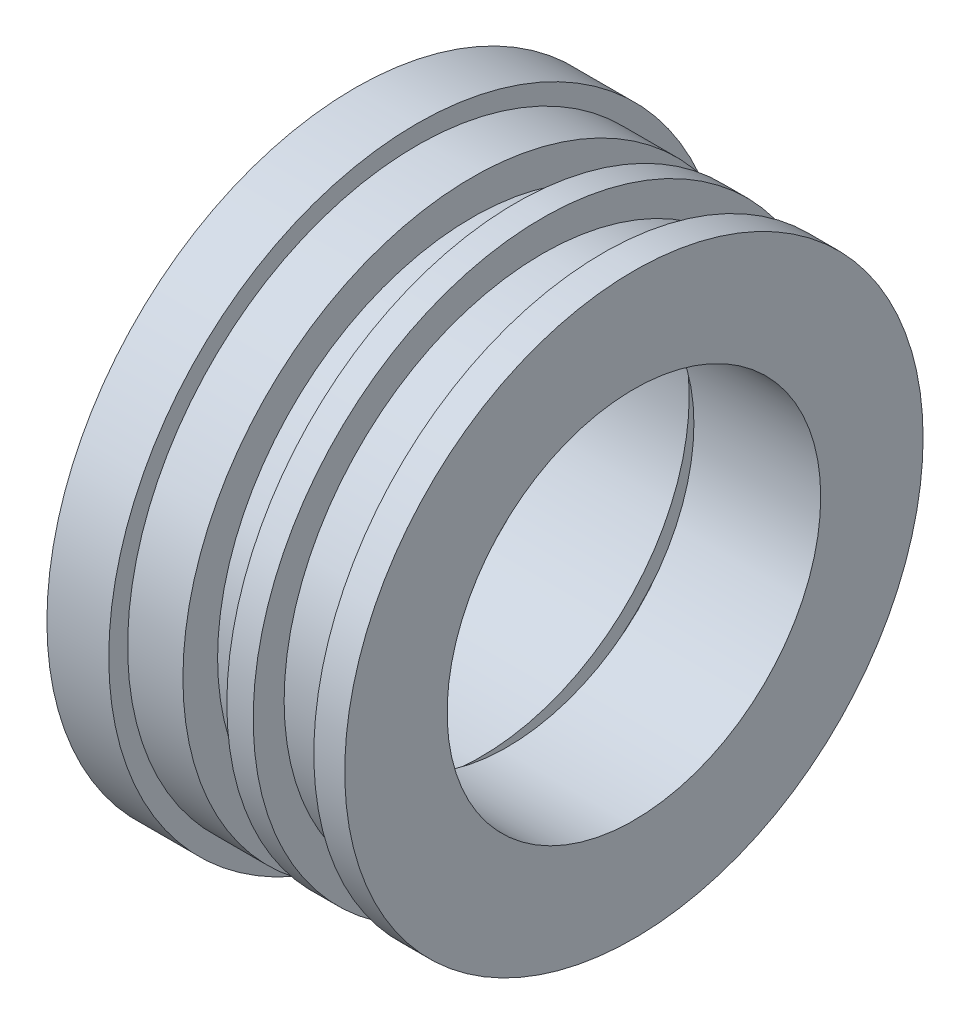
ISO-10303-21;
HEADER;
FILE_DESCRIPTION(('STEP AP214'),'2;1');
FILE_NAME('part.step','',(''),(''),'','','');
FILE_SCHEMA(('AUTOMOTIVE_DESIGN { 1 0 10303 214 1 1 1 1 }'));
ENDSEC;
DATA;
#1=APPLICATION_CONTEXT('core data for automotive mechanical design processes');
#2=APPLICATION_PROTOCOL_DEFINITION('international standard','automotive_design',2000,#1);
#3=PRODUCT_CONTEXT('',#1,'mechanical');
#4=PRODUCT('Part','Part','',(#3));
#5=PRODUCT_RELATED_PRODUCT_CATEGORY('part','',(#4));
#6=PRODUCT_DEFINITION_FORMATION('','',#4);
#7=PRODUCT_DEFINITION_CONTEXT('part definition',#1,'design');
#8=PRODUCT_DEFINITION('design','',#6,#7);
#9=PRODUCT_DEFINITION_SHAPE('','',#8);
#10=(LENGTH_UNIT() NAMED_UNIT(*) SI_UNIT(.MILLI.,.METRE.));
#11=(NAMED_UNIT(*) PLANE_ANGLE_UNIT() SI_UNIT($,.RADIAN.));
#12=(NAMED_UNIT(*) SI_UNIT($,.STERADIAN.) SOLID_ANGLE_UNIT());
#13=UNCERTAINTY_MEASURE_WITH_UNIT(LENGTH_MEASURE(1.E-05),#10,'distance_accuracy_value','');
#14=(GEOMETRIC_REPRESENTATION_CONTEXT(3) GLOBAL_UNCERTAINTY_ASSIGNED_CONTEXT((#13)) GLOBAL_UNIT_ASSIGNED_CONTEXT((#10,
#11,#12)) REPRESENTATION_CONTEXT('',''));
#15=CARTESIAN_POINT('',(0.,0.,0.));
#16=DIRECTION('',(0.,0.,1.));
#17=DIRECTION('',(1.,0.,0.));
#18=AXIS2_PLACEMENT_3D('',#15,#16,#17);
#19=CARTESIAN_POINT('',(0.,0.,0.));
#20=DIRECTION('',(1.,0.,0.));
#21=DIRECTION('',(0.,0.,-1.));
#22=AXIS2_PLACEMENT_3D('',#19,#20,#21);
#23=CYLINDRICAL_SURFACE('',#22,11.8745);
#24=CARTESIAN_POINT('',(-3.7084,0.,0.));
#25=DIRECTION('',(1.,0.,0.));
#26=DIRECTION('',(0.,0.,-1.));
#27=AXIS2_PLACEMENT_3D('',#24,#25,#26);
#28=CIRCLE('',#27,11.8745);
#29=CARTESIAN_POINT('',(-3.7084,0.,-11.8745));
#30=VERTEX_POINT('',#29);
#31=EDGE_CURVE('E96',#30,#30,#28,.T.);
#32=ORIENTED_EDGE('',*,*,#31,.T.);
#33=EDGE_LOOP('',(#32));
#34=FACE_BOUND('',#33,.T.);
#35=CARTESIAN_POINT('',(-1.43830595774119,0.,0.));
#36=DIRECTION('',(-1.,0.,0.));
#37=DIRECTION('',(0.,0.,1.));
#38=AXIS2_PLACEMENT_3D('',#35,#36,#37);
#39=CIRCLE('',#38,11.8745);
#40=CARTESIAN_POINT('',(-1.43830595774119,0.,11.8745));
#41=VERTEX_POINT('',#40);
#42=EDGE_CURVE('E109',#41,#41,#39,.T.);
#43=ORIENTED_EDGE('',*,*,#42,.T.);
#44=EDGE_LOOP('',(#43));
#45=FACE_BOUND('',#44,.T.);
#46=ADVANCED_FACE('F47',(#34,#45),#23,.T.);
#47=CARTESIAN_POINT('',(1.4478,0.,0.));
#48=DIRECTION('',(1.,0.,0.));
#49=DIRECTION('',(0.,0.,-1.));
#50=AXIS2_PLACEMENT_3D('',#47,#48,#49);
#51=CIRCLE('',#50,11.8745);
#52=CARTESIAN_POINT('',(1.4478,0.,-11.8745));
#53=VERTEX_POINT('',#52);
#54=EDGE_CURVE('E93',#53,#53,#51,.T.);
#55=ORIENTED_EDGE('',*,*,#54,.F.);
#56=EDGE_LOOP('',(#55));
#57=FACE_BOUND('',#56,.T.);
#58=CARTESIAN_POINT('',(0.364997855458809,0.,0.));
#59=DIRECTION('',(-1.,0.,0.));
#60=DIRECTION('',(0.,0.,1.));
#61=AXIS2_PLACEMENT_3D('',#58,#59,#60);
#62=CIRCLE('',#61,11.8745);
#63=CARTESIAN_POINT('',(0.364997855458809,0.,11.8745));
#64=VERTEX_POINT('',#63);
#65=EDGE_CURVE('E329',#64,#64,#62,.T.);
#66=ORIENTED_EDGE('',*,*,#65,.F.);
#67=EDGE_LOOP('',(#66));
#68=FACE_BOUND('',#67,.T.);
#69=ADVANCED_FACE('F117',(#57,#68),#23,.T.);
#70=CARTESIAN_POINT('',(-0.536654051141194,11.8745,0.));
#71=DIRECTION('',(0.,1.,0.));
#72=DIRECTION('',(0.,0.,1.));
#73=AXIS2_PLACEMENT_3D('',#70,#71,#72);
#74=CYLINDRICAL_SURFACE('',#73,0.396874999999999);
#75=CARTESIAN_POINT('',(-0.536654051141194,9.16290753093205,0.396874999999999));
#76=CARTESIAN_POINT('',(-0.55893549420947,9.16290764654025,0.396874015394312));
#77=CARTESIAN_POINT('',(-0.581232827780028,9.1629896769545,0.394992304834452));
#78=CARTESIAN_POINT('',(-0.625212646336671,9.16330900125434,0.387512330730099));
#79=CARTESIAN_POINT('',(-0.64689437119094,9.1635464790644,0.381909664457492));
#80=CARTESIAN_POINT('',(-0.688999499810687,9.16414974734482,0.36714826181482));
#81=CARTESIAN_POINT('',(-0.709423528939222,9.16451547343076,0.357991309554863));
#82=CARTESIAN_POINT('',(-0.74843896426603,9.16533394661552,0.336383936914734));
#83=CARTESIAN_POINT('',(-0.76703080738109,9.16578667289128,0.323934304353078));
#84=CARTESIAN_POINT('',(-0.8018744901568,9.16672854626737,0.296083826634229));
#85=CARTESIAN_POINT('',(-0.818124707018885,9.16721771827261,0.280680951880479));
#86=CARTESIAN_POINT('',(-0.847810060504705,9.16817712466524,0.247365161774987));
#87=CARTESIAN_POINT('',(-0.861245083326749,9.16864735828644,0.229452145001837));
#88=CARTESIAN_POINT('',(-0.884922697491104,9.16951606742829,0.191616632712358));
#89=CARTESIAN_POINT('',(-0.895164092616592,9.16991451603736,0.171693387927077));
#90=CARTESIAN_POINT('',(-0.912156038355141,9.17059451015949,0.130408257615304));
#91=CARTESIAN_POINT('',(-0.918906610510032,9.17087605639396,0.109046380967512));
#92=CARTESIAN_POINT('',(-0.928721185755424,9.17129035519573,0.0655046837947326));
#93=CARTESIAN_POINT('',(-0.931787517067236,9.17142320172877,0.0433253889738296));
#94=CARTESIAN_POINT('',(-0.934153750700042,9.17152544391363,-0.00123349577028818));
#95=CARTESIAN_POINT('',(-0.933453676933559,9.17149484060316,-0.0236130844209572));
#96=CARTESIAN_POINT('',(-0.928308913164991,9.17127371163039,-0.0679215175590638));
#97=CARTESIAN_POINT('',(-0.923866730706775,9.17108329305877,-0.0898506538120457));
#98=CARTESIAN_POINT('',(-0.911367731529938,9.17056411004272,-0.132651670910134));
#99=CARTESIAN_POINT('',(-0.903310902466991,9.17023534512582,-0.15352354814434));
#100=CARTESIAN_POINT('',(-0.883808447024237,9.16947632596091,-0.1936256502077));
#101=CARTESIAN_POINT('',(-0.872361675478607,9.16904603742692,-0.212855317444607));
#102=CARTESIAN_POINT('',(-0.84640510666651,9.16813244208049,-0.249121040272883));
#103=CARTESIAN_POINT('',(-0.831895293504161,9.16764913499291,-0.266157084479543));
#104=CARTESIAN_POINT('',(-0.800210339645169,9.16668347797584,-0.297566591025905));
#105=CARTESIAN_POINT('',(-0.783033023621281,9.16620112915587,-0.311937859087363));
#106=CARTESIAN_POINT('',(-0.746508317749233,9.16529216655227,-0.337592967010331));
#107=CARTESIAN_POINT('',(-0.727160927424006,9.1648655527809,-0.348876806193099));
#108=CARTESIAN_POINT('',(-0.686843983818843,9.1641161973683,-0.368036540637774));
#109=CARTESIAN_POINT('',(-0.665874393390031,9.16379345810671,-0.375912357827693));
#110=CARTESIAN_POINT('',(-0.622908881237655,9.16328833993912,-0.388031038375738));
#111=CARTESIAN_POINT('',(-0.600912965299867,9.16310596024195,-0.392273922211447));
#112=CARTESIAN_POINT('',(-0.556538290268574,9.16290227263207,-0.39700359082162));
#113=CARTESIAN_POINT('',(-0.534159856131958,9.16288083420858,-0.397493419036865));
#114=CARTESIAN_POINT('',(-0.489638597404038,9.16300110603511,-0.39471100987086));
#115=CARTESIAN_POINT('',(-0.467495772232488,9.16314281588323,-0.391438781756776));
#116=CARTESIAN_POINT('',(-0.424082810766057,9.16357329202787,-0.38122766917061));
#117=CARTESIAN_POINT('',(-0.402812347132656,9.16386200260918,-0.374290173845575));
#118=CARTESIAN_POINT('',(-0.361737826979347,9.16455389021936,-0.356946863162246));
#119=CARTESIAN_POINT('',(-0.341933776782567,9.16495706774178,-0.346541032849665));
#120=CARTESIAN_POINT('',(-0.304340238377882,9.165832762278,-0.322548610727813));
#121=CARTESIAN_POINT('',(-0.286552057350855,9.16630532383285,-0.308959972356012));
#122=CARTESIAN_POINT('',(-0.253508339851837,9.16726636302114,-0.278990661224119));
#123=CARTESIAN_POINT('',(-0.238252815749091,9.16775484073229,-0.262609974828733));
#124=CARTESIAN_POINT('',(-0.21069725913481,9.16869303302902,-0.22750849690576));
#125=CARTESIAN_POINT('',(-0.198399191037115,9.16914272172353,-0.208786162478011));
#126=CARTESIAN_POINT('',(-0.177121069980114,9.1699522819356,-0.169540668559037));
#127=CARTESIAN_POINT('',(-0.168141005297789,9.17031215377049,-0.1490175154307));
#128=CARTESIAN_POINT('',(-0.153757243470496,9.170901395225,-0.106760307309313));
#129=CARTESIAN_POINT('',(-0.148352283501601,9.17113081092126,-0.0850266828317771));
#130=CARTESIAN_POINT('',(-0.141268020872158,9.17143346581654,-0.0409594192158822));
#131=CARTESIAN_POINT('',(-0.139588704159097,9.17150670560463,-0.0186257823409932));
#132=CARTESIAN_POINT('',(-0.140003541822074,9.17148875702802,0.0259880023150937));
#133=CARTESIAN_POINT('',(-0.142094610861622,9.17139770310611,0.0482681789053225));
#134=CARTESIAN_POINT('',(-0.149984494418193,9.17106168562975,0.0921608663180783));
#135=CARTESIAN_POINT('',(-0.155783316080874,9.17081672177868,0.113773375853779));
#136=CARTESIAN_POINT('',(-0.170923512723298,9.17020045675352,0.155717998666665));
#137=CARTESIAN_POINT('',(-0.180264929918024,9.16982915407393,0.176050096682589));
#138=CARTESIAN_POINT('',(-0.202224513044887,9.16900200011743,0.214857363513308));
#139=CARTESIAN_POINT('',(-0.21484257138589,9.16854615161679,0.233332593272234));
#140=CARTESIAN_POINT('',(-0.243007938377383,9.16760081906724,0.267916860190384));
#141=CARTESIAN_POINT('',(-0.25855732117506,9.16711131135848,0.284024207431201));
#142=CARTESIAN_POINT('',(-0.292144023722983,9.16615395986057,0.313404649946203));
#143=CARTESIAN_POINT('',(-0.31018195616656,9.16568612144451,0.326677045184091));
#144=CARTESIAN_POINT('',(-0.348245100441699,9.16482461786264,0.35001548555261));
#145=CARTESIAN_POINT('',(-0.368271962194627,9.16443101507716,0.360078838980908));
#146=CARTESIAN_POINT('',(-0.409717533260866,9.16376340667975,0.376688413917017));
#147=CARTESIAN_POINT('',(-0.431134558401075,9.16348925934459,0.383238805382872));
#148=CARTESIAN_POINT('',(-0.466680285249897,9.16316433715958,0.390911360653705));
#149=CARTESIAN_POINT('',(-0.480578553979618,9.16306845705027,0.393144886446108));
#150=CARTESIAN_POINT('',(-0.508533788815366,9.16294001747247,0.39612701637594));
#151=CARTESIAN_POINT('',(-0.522590754821293,9.16290745796404,0.396875621449942));
#152=CARTESIAN_POINT('',(-0.536654051141194,9.16290753093205,0.396874999999999));
#153=B_SPLINE_CURVE_WITH_KNOTS('',3,(#75,#76,#77,#78,#79,#80,#81,#82,#83,#84,#85,#86,#87,#88,
#89,#90,#91,#92,#93,#94,#95,#96,#97,#98,#99,#100,#101,#102,#103,#104,#105,#106,#107,#108,#109,
#110,#111,#112,#113,#114,#115,#116,#117,#118,#119,#120,#121,#122,#123,#124,#125,#126,#127,#128,
#129,#130,#131,#132,#133,#134,#135,#136,#137,#138,#139,#140,#141,#142,#143,#144,#145,#146,#147,
#148,#149,#150,#151,#152),.UNSPECIFIED.,.T.,.F.,(4,2,2,2,2,2,2,2,2,2,2,2,2,2,2,2,2,2,2,2,2,2,2,
2,2,2,2,2,2,2,2,2,2,2,2,2,2,2,4),(0.,0.066792994182018,0.133665160646893,0.20050380326467,
0.267326468273378,0.334195222407943,0.401066679130561,0.467963153466716,0.534859214980546,
0.601712979886322,0.66856632034487,0.735374898752619,0.802183705319103,0.869015106547053,
0.93584685461005,1.00273339243748,1.06961994496926,1.13650802967711,1.20339573735761,
1.27022919848142,1.33706249497307,1.40387047960057,1.47067875228522,1.53753010155023,
1.60438177730097,1.67127773565758,1.73817345765813,1.80504553763919,1.87191736538931,
1.93873449622626,2.00555175583498,2.07236981168991,2.13918567379787,2.20604899215641,
2.27292880207334,2.33986456323509,2.40672069341798,2.44887820803022,2.49103569605273),.UNSPECIFIED.);
#154=CARTESIAN_POINT('',(-0.536654051141194,9.16290753093205,0.396874999999999));
#155=VERTEX_POINT('',#154);
#156=EDGE_CURVE('E102',#155,#155,#153,.T.);
#157=ORIENTED_EDGE('',*,*,#156,.T.);
#158=EDGE_LOOP('',(#157));
#159=FACE_BOUND('',#158,.T.);
#160=CARTESIAN_POINT('',(-0.536654051141194,10.4428558993721,0.396874999999999));
#161=CARTESIAN_POINT('',(-0.55893806821995,10.4428560009423,0.396874014454095));
#162=CARTESIAN_POINT('',(-0.581238038719293,10.4429279935437,0.394991870861255));
#163=CARTESIAN_POINT('',(-0.625223235145033,10.4432082482024,0.387510076336908));
#164=CARTESIAN_POINT('',(-0.646907698136307,10.4434166722796,0.381906005292855));
#165=CARTESIAN_POINT('',(-0.689018317105908,10.4439461461416,0.367140651888283));
#166=CARTESIAN_POINT('',(-0.709445091611033,10.4442671400363,0.357981134537887));
#167=CARTESIAN_POINT('',(-0.748465473860025,10.4449855128291,0.336367486687425));
#168=CARTESIAN_POINT('',(-0.767059522599934,10.4453828732834,0.323914151425433));
#169=CARTESIAN_POINT('',(-0.801904281667392,10.4462095005498,0.296057208971475));
#170=CARTESIAN_POINT('',(-0.818153685122021,10.4466387849556,0.280651967478336));
#171=CARTESIAN_POINT('',(-0.847836820727282,10.4474807172426,0.247331584352272));
#172=CARTESIAN_POINT('',(-0.861270439805925,10.4478933644551,0.229416341974728));
#173=CARTESIAN_POINT('',(-0.884943540794917,10.4486556248149,0.191578600347924));
#174=CARTESIAN_POINT('',(-0.895182115343414,10.4490052200439,0.17165553301699));
#175=CARTESIAN_POINT('',(-0.912168634879512,10.4496018136629,0.130371706655994));
#176=CARTESIAN_POINT('',(-0.918916598066946,10.4498488125876,0.109010955122586));
#177=CARTESIAN_POINT('',(-0.928727196379884,10.4502122663807,0.0654691252835978));
#178=CARTESIAN_POINT('',(-0.931791623576207,10.450328784727,0.0432884512955195));
#179=CARTESIAN_POINT('',(-0.934153687813634,10.4504183570732,-0.00127277281257569));
#180=CARTESIAN_POINT('',(-0.933451344838731,10.4503914118341,-0.0236533218715586));
#181=CARTESIAN_POINT('',(-0.928301305358876,10.4501971479455,-0.0679668587195005));
#182=CARTESIAN_POINT('',(-0.923855540328519,10.4500299016865,-0.0899000713421345));
#183=CARTESIAN_POINT('',(-0.911347846418612,10.4495739645296,-0.132708639202626));
#184=CARTESIAN_POINT('',(-0.90328590713117,10.4492852732823,-0.15358399139561));
#185=CARTESIAN_POINT('',(-0.883772501793676,10.4486188522676,-0.193690485499082));
#186=CARTESIAN_POINT('',(-0.872320152290199,10.4482410992983,-0.212921197173207));
#187=CARTESIAN_POINT('',(-0.846351667551777,10.4474391162008,-0.249187810050953));
#188=CARTESIAN_POINT('',(-0.83183552035259,10.4470148858911,-0.266223702683308));
#189=CARTESIAN_POINT('',(-0.800140572758892,10.4461674295161,-0.297628351243839));
#190=CARTESIAN_POINT('',(-0.782960096753091,10.445744204254,-0.311995416147774));
#191=CARTESIAN_POINT('',(-0.746430083571325,10.4449467417778,-0.337641559854101));
#192=CARTESIAN_POINT('',(-0.727080545976638,10.444572504573,-0.348920638060376));
#193=CARTESIAN_POINT('',(-0.686760696798609,10.4439152377216,-0.368070465598597));
#194=CARTESIAN_POINT('',(-0.665790357732298,10.4436322096219,-0.375941157121605));
#195=CARTESIAN_POINT('',(-0.622824617876909,10.4431893386804,-0.38804968889572));
#196=CARTESIAN_POINT('',(-0.600829221544799,10.443029495303,-0.392287544940908));
#197=CARTESIAN_POINT('',(-0.556452454791846,10.4428511157939,-0.397008028056378));
#198=CARTESIAN_POINT('',(-0.534071334076011,10.4428324914488,-0.397492999394221));
#199=CARTESIAN_POINT('',(-0.489545506504722,10.4429384199271,-0.394700058521904));
#200=CARTESIAN_POINT('',(-0.467400799203537,10.4430629724805,-0.391422153407488));
#201=CARTESIAN_POINT('',(-0.423982961766447,10.4434411343892,-0.381198449850113));
#202=CARTESIAN_POINT('',(-0.402709579801709,10.4436947061671,-0.374253719362707));
#203=CARTESIAN_POINT('',(-0.361630525191999,10.4443022912521,-0.356894582386977));
#204=CARTESIAN_POINT('',(-0.341824857385168,10.4446563048903,-0.346480164461871));
#205=CARTESIAN_POINT('',(-0.304232647440754,10.4454250834767,-0.322471246027634));
#206=CARTESIAN_POINT('',(-0.286447113443857,10.4458398785232,-0.308875167989394));
#207=CARTESIAN_POINT('',(-0.253410168674286,10.4466833563122,-0.278891184370213));
#208=CARTESIAN_POINT('',(-0.238158767660977,10.4471120391083,-0.262503268037937));
#209=CARTESIAN_POINT('',(-0.210615177459123,10.4479352270029,-0.227390750259213));
#210=CARTESIAN_POINT('',(-0.198324500710201,10.4483297145677,-0.208664961931504));
#211=CARTESIAN_POINT('',(-0.177061583929939,10.4490397965235,-0.169414288742466));
#212=CARTESIAN_POINT('',(-0.168089334048794,10.4493553911486,-0.14888940922145));
#213=CARTESIAN_POINT('',(-0.153720612163672,10.4498720304327,-0.106628856195161));
#214=CARTESIAN_POINT('',(-0.148323164587921,10.4500731063421,-0.0848935147845179));
#215=CARTESIAN_POINT('',(-0.141254063748455,10.4503381676735,-0.0408243428326085));
#216=CARTESIAN_POINT('',(-0.139582401207219,10.4504021534369,-0.0184905137817671));
#217=CARTESIAN_POINT('',(-0.140012432308906,10.4503858243691,0.0261265912113033));
#218=CARTESIAN_POINT('',(-0.142111747864787,10.4503056004808,0.0484098901468196));
#219=CARTESIAN_POINT('',(-0.150019241516118,10.4500100675168,0.092307488946538));
#220=CARTESIAN_POINT('',(-0.155827426853614,10.4497947581775,0.113921787504344));
#221=CARTESIAN_POINT('',(-0.170987373310459,10.4492532964665,0.155868524391291));
#222=CARTESIAN_POINT('',(-0.180339185379096,10.4489271425011,0.176200944285031));
#223=CARTESIAN_POINT('',(-0.20232033967993,10.44820071751,0.215006935595023));
#224=CARTESIAN_POINT('',(-0.214949569474729,10.4478004490271,0.233480570749885));
#225=CARTESIAN_POINT('',(-0.243134955791281,10.4469706047665,0.268056080897783));
#226=CARTESIAN_POINT('',(-0.258692640835452,10.4465410137588,0.284156709427179));
#227=CARTESIAN_POINT('',(-0.292294726232388,10.445700998314,0.313522227842461));
#228=CARTESIAN_POINT('',(-0.310339740030676,10.4452905786387,0.326786416116729));
#229=CARTESIAN_POINT('',(-0.348413711650637,10.4445350046134,0.350106119504125));
#230=CARTESIAN_POINT('',(-0.368444153026003,10.4441898996368,0.360159211170823));
#231=CARTESIAN_POINT('',(-0.409894574539445,10.4436047248024,0.376747928479295));
#232=CARTESIAN_POINT('',(-0.431312868857983,10.4433645301586,0.383287735157076));
#233=CARTESIAN_POINT('',(-0.466830438823598,10.4430802624131,0.390937117466862));
#234=CARTESIAN_POINT('',(-0.48069933462026,10.4429964936714,0.393161007753105));
#235=CARTESIAN_POINT('',(-0.508594728573561,10.4428842801835,0.396130258976751));
#236=CARTESIAN_POINT('',(-0.522621226654547,10.4428558354107,0.396875620623859));
#237=CARTESIAN_POINT('',(-0.536654051141194,10.4428558993721,0.396874999999999));
#238=B_SPLINE_CURVE_WITH_KNOTS('',3,(#160,#161,#162,#163,#164,#165,#166,#167,#168,#169,#170,
#171,#172,#173,#174,#175,#176,#177,#178,#179,#180,#181,#182,#183,#184,#185,#186,#187,#188,#189,
#190,#191,#192,#193,#194,#195,#196,#197,#198,#199,#200,#201,#202,#203,#204,#205,#206,#207,#208,
#209,#210,#211,#212,#213,#214,#215,#216,#217,#218,#219,#220,#221,#222,#223,#224,#225,#226,#227,
#228,#229,#230,#231,#232,#233,#234,#235,#236,#237),.UNSPECIFIED.,.T.,.F.,(4,2,2,2,2,2,2,2,2,2,2,
2,2,2,2,2,2,2,2,2,2,2,2,2,2,2,2,2,2,2,2,2,2,2,2,2,2,2,4),(0.,0.0668008284005457,
0.133681130790567,0.200528274542901,0.267359293862375,0.334227421152642,0.401098233117286,
0.467988018501752,0.534877455123475,0.601734336291143,0.668590862760743,0.735412914728533,
0.802235159021433,0.869074830816042,0.935914763626861,1.00279690420532,1.06967905769497,
1.1365623455145,1.20344534255138,1.27028655724772,1.33712764590021,1.40394927794891,
1.47077113025722,1.53762618460459,1.6044814964158,1.67137088813556,1.73826008131164,
1.8051310127432,1.87200177766026,1.93883038675719,2.00565912634597,2.07248882681641,
2.13931623488318,2.2061786210739,2.27305752702094,2.33998678853001,2.40683622245256,
2.44890245975421,2.49096867686374),.UNSPECIFIED.);
#239=CARTESIAN_POINT('',(-0.536654051141194,10.4428558993721,0.396874999999999));
#240=VERTEX_POINT('',#239);
#241=EDGE_CURVE('E51',#240,#240,#238,.T.);
#242=ORIENTED_EDGE('',*,*,#241,.F.);
#243=EDGE_LOOP('',(#242));
#244=FACE_BOUND('',#243,.T.);
#245=ADVANCED_FACE('F113',(#159,#244),#74,.F.);
#246=CARTESIAN_POINT('',(0.,0.,0.));
#247=DIRECTION('',(1.,0.,0.));
#248=DIRECTION('',(0.,0.,-1.));
#249=AXIS2_PLACEMENT_3D('',#246,#247,#248);
#250=CYLINDRICAL_SURFACE('',#249,12.6492);
#251=CARTESIAN_POINT('',(-6.2484,0.,0.));
#252=DIRECTION('',(1.,0.,0.));
#253=DIRECTION('',(0.,0.,-1.));
#254=AXIS2_PLACEMENT_3D('',#251,#252,#253);
#255=CIRCLE('',#254,12.6492);
#256=CARTESIAN_POINT('',(-6.2484,0.,-12.6492));
#257=VERTEX_POINT('',#256);
#258=EDGE_CURVE('E12',#257,#257,#255,.T.);
#259=ORIENTED_EDGE('',*,*,#258,.T.);
#260=EDGE_LOOP('',(#259));
#261=FACE_BOUND('',#260,.T.);
#262=CARTESIAN_POINT('',(-3.7084,0.,0.));
#263=DIRECTION('',(1.,0.,0.));
#264=DIRECTION('',(0.,0.,-1.));
#265=AXIS2_PLACEMENT_3D('',#262,#263,#264);
#266=CIRCLE('',#265,12.6492);
#267=CARTESIAN_POINT('',(-3.7084,0.,-12.6492));
#268=VERTEX_POINT('',#267);
#269=EDGE_CURVE('E99',#268,#268,#266,.T.);
#270=ORIENTED_EDGE('',*,*,#269,.F.);
#271=EDGE_LOOP('',(#270));
#272=FACE_BOUND('',#271,.T.);
#273=ADVANCED_FACE('F49',(#261,#272),#250,.T.);
#274=CARTESIAN_POINT('',(-6.2484,12.6492,0.));
#275=DIRECTION('',(-1.,0.,0.));
#276=DIRECTION('',(0.,0.,1.));
#277=AXIS2_PLACEMENT_3D('',#274,#275,#276);
#278=PLANE('',#277);
#279=CARTESIAN_POINT('',(-6.2484,0.,0.));
#280=DIRECTION('',(1.,0.,0.));
#281=DIRECTION('',(0.,0.,-1.));
#282=AXIS2_PLACEMENT_3D('',#279,#280,#281);
#283=CIRCLE('',#282,8.550800018);
#284=CARTESIAN_POINT('',(-6.2484,0.,-8.550800018));
#285=VERTEX_POINT('',#284);
#286=EDGE_CURVE('E60',#285,#285,#283,.T.);
#287=ORIENTED_EDGE('',*,*,#286,.T.);
#288=EDGE_LOOP('',(#287));
#289=FACE_BOUND('',#288,.T.);
#290=ORIENTED_EDGE('',*,*,#258,.F.);
#291=EDGE_LOOP('',(#290));
#292=FACE_BOUND('',#291,.T.);
#293=ADVANCED_FACE('F183',(#289,#292),#278,.T.);
#294=CARTESIAN_POINT('',(0.,0.,0.));
#295=DIRECTION('',(1.,0.,0.));
#296=DIRECTION('',(0.,0.,-1.));
#297=AXIS2_PLACEMENT_3D('',#294,#295,#296);
#298=CYLINDRICAL_SURFACE('',#297,8.550800018);
#299=CARTESIAN_POINT('',(-1.07330810228239,0.,0.));
#300=DIRECTION('',(1.,0.,0.));
#301=DIRECTION('',(0.,0.,-1.));
#302=AXIS2_PLACEMENT_3D('',#299,#300,#301);
#303=CIRCLE('',#302,8.550800018);
#304=CARTESIAN_POINT('',(-1.07330810228239,0.,-8.550800018));
#305=VERTEX_POINT('',#304);
#306=EDGE_CURVE('E64',#305,#305,#303,.T.);
#307=ORIENTED_EDGE('',*,*,#306,.T.);
#308=EDGE_LOOP('',(#307));
#309=FACE_BOUND('',#308,.T.);
#310=ORIENTED_EDGE('',*,*,#286,.F.);
#311=EDGE_LOOP('',(#310));
#312=FACE_BOUND('',#311,.T.);
#313=ADVANCED_FACE('F180',(#309,#312),#298,.F.);
#314=CARTESIAN_POINT('',(-1.07330810228239,8.550800018,0.));
#315=DIRECTION('',(1.,0.,0.));
#316=DIRECTION('',(0.,0.,-1.));
#317=AXIS2_PLACEMENT_3D('',#314,#315,#316);
#318=PLANE('',#317);
#319=CARTESIAN_POINT('',(-1.07330810228239,0.,0.));
#320=DIRECTION('',(1.,0.,0.));
#321=DIRECTION('',(0.,0.,-1.));
#322=AXIS2_PLACEMENT_3D('',#319,#320,#321);
#323=CIRCLE('',#322,9.17149847004491);
#324=CARTESIAN_POINT('',(-1.07330810228239,0.,-9.17149847004491));
#325=VERTEX_POINT('',#324);
#326=EDGE_CURVE('E69',#325,#325,#323,.T.);
#327=ORIENTED_EDGE('',*,*,#326,.T.);
#328=EDGE_LOOP('',(#327));
#329=FACE_BOUND('',#328,.T.);
#330=ORIENTED_EDGE('',*,*,#306,.F.);
#331=EDGE_LOOP('',(#330));
#332=FACE_BOUND('',#331,.T.);
#333=ADVANCED_FACE('F176',(#329,#332),#318,.T.);
#334=CARTESIAN_POINT('',(0.,0.,0.));
#335=DIRECTION('',(1.,0.,0.));
#336=DIRECTION('',(0.,0.,-1.));
#337=AXIS2_PLACEMENT_3D('',#334,#335,#336);
#338=CYLINDRICAL_SURFACE('',#337,9.17149847004491);
#339=ORIENTED_EDGE('',*,*,#156,.F.);
#340=EDGE_LOOP('',(#339));
#341=FACE_BOUND('',#340,.T.);
#342=CARTESIAN_POINT('',(0.,0.,0.));
#343=DIRECTION('',(1.,0.,0.));
#344=DIRECTION('',(0.,0.,-1.));
#345=AXIS2_PLACEMENT_3D('',#342,#343,#344);
#346=CIRCLE('',#345,9.17149847004491);
#347=CARTESIAN_POINT('',(0.,0.,-9.17149847004491));
#348=VERTEX_POINT('',#347);
#349=EDGE_CURVE('E72',#348,#348,#346,.T.);
#350=ORIENTED_EDGE('',*,*,#349,.T.);
#351=EDGE_LOOP('',(#350));
#352=FACE_BOUND('',#351,.T.);
#353=ORIENTED_EDGE('',*,*,#326,.F.);
#354=EDGE_LOOP('',(#353));
#355=FACE_BOUND('',#354,.T.);
#356=ADVANCED_FACE('F173',(#341,#352,#355),#338,.F.);
#357=CARTESIAN_POINT('',(0.,8.550800018,0.));
#358=DIRECTION('',(-1.,0.,0.));
#359=DIRECTION('',(0.,0.,1.));
#360=AXIS2_PLACEMENT_3D('',#357,#358,#359);
#361=PLANE('',#360);
#362=CARTESIAN_POINT('',(0.,0.,0.));
#363=DIRECTION('',(1.,0.,0.));
#364=DIRECTION('',(0.,0.,-1.));
#365=AXIS2_PLACEMENT_3D('',#362,#363,#364);
#366=CIRCLE('',#365,7.6708);
#367=CARTESIAN_POINT('',(0.,0.,-7.6708));
#368=VERTEX_POINT('',#367);
#369=EDGE_CURVE('E75',#368,#368,#366,.T.);
#370=ORIENTED_EDGE('',*,*,#369,.T.);
#371=EDGE_LOOP('',(#370));
#372=FACE_BOUND('',#371,.T.);
#373=ORIENTED_EDGE('',*,*,#349,.F.);
#374=EDGE_LOOP('',(#373));
#375=FACE_BOUND('',#374,.T.);
#376=ADVANCED_FACE('F169',(#372,#375),#361,.T.);
#377=CARTESIAN_POINT('',(0.,0.,0.));
#378=DIRECTION('',(1.,0.,0.));
#379=DIRECTION('',(0.,0.,-1.));
#380=AXIS2_PLACEMENT_3D('',#377,#378,#379);
#381=CYLINDRICAL_SURFACE('',#380,7.6708);
#382=CARTESIAN_POINT('',(5.207,0.,0.));
#383=DIRECTION('',(1.,0.,0.));
#384=DIRECTION('',(0.,0.,-1.));
#385=AXIS2_PLACEMENT_3D('',#382,#383,#384);
#386=CIRCLE('',#385,7.6708);
#387=CARTESIAN_POINT('',(5.207,0.,-7.6708));
#388=VERTEX_POINT('',#387);
#389=EDGE_CURVE('E78',#388,#388,#386,.T.);
#390=ORIENTED_EDGE('',*,*,#389,.T.);
#391=EDGE_LOOP('',(#390));
#392=FACE_BOUND('',#391,.T.);
#393=ORIENTED_EDGE('',*,*,#369,.F.);
#394=EDGE_LOOP('',(#393));
#395=FACE_BOUND('',#394,.T.);
#396=ADVANCED_FACE('F165',(#392,#395),#381,.F.);
#397=CARTESIAN_POINT('',(5.207,7.6708,0.));
#398=DIRECTION('',(1.,0.,0.));
#399=DIRECTION('',(0.,0.,-1.));
#400=AXIS2_PLACEMENT_3D('',#397,#398,#399);
#401=PLANE('',#400);
#402=CARTESIAN_POINT('',(5.207,0.,0.));
#403=DIRECTION('',(1.,0.,0.));
#404=DIRECTION('',(0.,0.,-1.));
#405=AXIS2_PLACEMENT_3D('',#402,#403,#404);
#406=CIRCLE('',#405,11.8745);
#407=CARTESIAN_POINT('',(5.207,0.,-11.8745));
#408=VERTEX_POINT('',#407);
#409=EDGE_CURVE('E81',#408,#408,#406,.T.);
#410=ORIENTED_EDGE('',*,*,#409,.T.);
#411=EDGE_LOOP('',(#410));
#412=FACE_BOUND('',#411,.T.);
#413=ORIENTED_EDGE('',*,*,#389,.F.);
#414=EDGE_LOOP('',(#413));
#415=FACE_BOUND('',#414,.T.);
#416=ADVANCED_FACE('F161',(#412,#415),#401,.T.);
#417=CARTESIAN_POINT('',(0.,0.,0.));
#418=DIRECTION('',(1.,0.,0.));
#419=DIRECTION('',(0.,0.,-1.));
#420=AXIS2_PLACEMENT_3D('',#417,#418,#419);
#421=CYLINDRICAL_SURFACE('',#420,11.8745);
#422=CARTESIAN_POINT('',(3.937,0.,0.));
#423=DIRECTION('',(1.,0.,0.));
#424=DIRECTION('',(0.,0.,-1.));
#425=AXIS2_PLACEMENT_3D('',#422,#423,#424);
#426=CIRCLE('',#425,11.8745);
#427=CARTESIAN_POINT('',(3.937,0.,-11.8745));
#428=VERTEX_POINT('',#427);
#429=EDGE_CURVE('E84',#428,#428,#426,.T.);
#430=ORIENTED_EDGE('',*,*,#429,.T.);
#431=EDGE_LOOP('',(#430));
#432=FACE_BOUND('',#431,.T.);
#433=ORIENTED_EDGE('',*,*,#409,.F.);
#434=EDGE_LOOP('',(#433));
#435=FACE_BOUND('',#434,.T.);
#436=ADVANCED_FACE('F157',(#432,#435),#421,.T.);
#437=CARTESIAN_POINT('',(3.937,10.6045,0.));
#438=DIRECTION('',(-1.,0.,0.));
#439=DIRECTION('',(0.,0.,1.));
#440=AXIS2_PLACEMENT_3D('',#437,#438,#439);
#441=PLANE('',#440);
#442=CARTESIAN_POINT('',(3.937,0.,0.));
#443=DIRECTION('',(1.,0.,0.));
#444=DIRECTION('',(0.,0.,-1.));
#445=AXIS2_PLACEMENT_3D('',#442,#443,#444);
#446=CIRCLE('',#445,10.6045);
#447=CARTESIAN_POINT('',(3.937,0.,-10.6045));
#448=VERTEX_POINT('',#447);
#449=EDGE_CURVE('E87',#448,#448,#446,.T.);
#450=ORIENTED_EDGE('',*,*,#449,.T.);
#451=EDGE_LOOP('',(#450));
#452=FACE_BOUND('',#451,.T.);
#453=ORIENTED_EDGE('',*,*,#429,.F.);
#454=EDGE_LOOP('',(#453));
#455=FACE_BOUND('',#454,.T.);
#456=ADVANCED_FACE('F153',(#452,#455),#441,.T.);
#457=CARTESIAN_POINT('',(0.,0.,0.));
#458=DIRECTION('',(1.,0.,0.));
#459=DIRECTION('',(0.,0.,-1.));
#460=AXIS2_PLACEMENT_3D('',#457,#458,#459);
#461=CYLINDRICAL_SURFACE('',#460,10.6045);
#462=CARTESIAN_POINT('',(1.4478,0.,0.));
#463=DIRECTION('',(1.,0.,0.));
#464=DIRECTION('',(0.,0.,-1.));
#465=AXIS2_PLACEMENT_3D('',#462,#463,#464);
#466=CIRCLE('',#465,10.6045);
#467=CARTESIAN_POINT('',(1.4478,0.,-10.6045));
#468=VERTEX_POINT('',#467);
#469=EDGE_CURVE('E90',#468,#468,#466,.T.);
#470=ORIENTED_EDGE('',*,*,#469,.T.);
#471=EDGE_LOOP('',(#470));
#472=FACE_BOUND('',#471,.T.);
#473=ORIENTED_EDGE('',*,*,#449,.F.);
#474=EDGE_LOOP('',(#473));
#475=FACE_BOUND('',#474,.T.);
#476=ADVANCED_FACE('F149',(#472,#475),#461,.T.);
#477=CARTESIAN_POINT('',(1.4478,11.8745,0.));
#478=DIRECTION('',(1.,0.,0.));
#479=DIRECTION('',(0.,0.,-1.));
#480=AXIS2_PLACEMENT_3D('',#477,#478,#479);
#481=PLANE('',#480);
#482=ORIENTED_EDGE('',*,*,#54,.T.);
#483=EDGE_LOOP('',(#482));
#484=FACE_BOUND('',#483,.T.);
#485=ORIENTED_EDGE('',*,*,#469,.F.);
#486=EDGE_LOOP('',(#485));
#487=FACE_BOUND('',#486,.T.);
#488=ADVANCED_FACE('F146',(#484,#487),#481,.T.);
#489=CARTESIAN_POINT('',(-3.7084,11.8745,0.));
#490=DIRECTION('',(1.,0.,0.));
#491=DIRECTION('',(0.,0.,-1.));
#492=AXIS2_PLACEMENT_3D('',#489,#490,#491);
#493=PLANE('',#492);
#494=ORIENTED_EDGE('',*,*,#269,.T.);
#495=EDGE_LOOP('',(#494));
#496=FACE_BOUND('',#495,.T.);
#497=ORIENTED_EDGE('',*,*,#31,.F.);
#498=EDGE_LOOP('',(#497));
#499=FACE_BOUND('',#498,.T.);
#500=ADVANCED_FACE('F128',(#496,#499),#493,.T.);
#501=CARTESIAN_POINT('',(-6.82117,0.,0.));
#502=DIRECTION('',(-1.,0.,0.));
#503=DIRECTION('',(0.,0.,1.));
#504=AXIS2_PLACEMENT_3D('',#501,#502,#503);
#505=CYLINDRICAL_SURFACE('',#504,10.4503946863588);
#506=CARTESIAN_POINT('',(0.364997855458809,0.,0.));
#507=DIRECTION('',(-1.,0.,0.));
#508=DIRECTION('',(0.,0.,1.));
#509=AXIS2_PLACEMENT_3D('',#506,#507,#508);
#510=CIRCLE('',#509,10.4503946863588);
#511=CARTESIAN_POINT('',(0.364997855458809,0.,10.4503946863588));
#512=VERTEX_POINT('',#511);
#513=EDGE_CURVE('E326',#512,#512,#510,.T.);
#514=ORIENTED_EDGE('',*,*,#513,.T.);
#515=EDGE_LOOP('',(#514));
#516=FACE_BOUND('',#515,.T.);
#517=CARTESIAN_POINT('',(-1.43830595774119,0.,0.));
#518=DIRECTION('',(-1.,0.,0.));
#519=DIRECTION('',(0.,0.,1.));
#520=AXIS2_PLACEMENT_3D('',#517,#518,#519);
#521=CIRCLE('',#520,10.4503946863588);
#522=CARTESIAN_POINT('',(-1.43830595774119,0.,10.4503946863588));
#523=VERTEX_POINT('',#522);
#524=EDGE_CURVE('E323',#523,#523,#521,.T.);
#525=ORIENTED_EDGE('',*,*,#524,.F.);
#526=EDGE_LOOP('',(#525));
#527=FACE_BOUND('',#526,.T.);
#528=ORIENTED_EDGE('',*,*,#241,.T.);
#529=EDGE_LOOP('',(#528));
#530=FACE_BOUND('',#529,.T.);
#531=ADVANCED_FACE('F123',(#516,#527,#530),#505,.T.);
#532=CARTESIAN_POINT('',(-1.43830595774119,11.8745,0.));
#533=DIRECTION('',(1.,0.,0.));
#534=DIRECTION('',(0.,0.,-1.));
#535=AXIS2_PLACEMENT_3D('',#532,#533,#534);
#536=PLANE('',#535);
#537=ORIENTED_EDGE('',*,*,#524,.T.);
#538=EDGE_LOOP('',(#537));
#539=FACE_BOUND('',#538,.T.);
#540=ORIENTED_EDGE('',*,*,#42,.F.);
#541=EDGE_LOOP('',(#540));
#542=FACE_BOUND('',#541,.T.);
#543=ADVANCED_FACE('F119',(#539,#542),#536,.T.);
#544=CARTESIAN_POINT('',(0.364997855458808,10.4503946863588,0.));
#545=DIRECTION('',(-1.,0.,0.));
#546=DIRECTION('',(0.,0.,1.));
#547=AXIS2_PLACEMENT_3D('',#544,#545,#546);
#548=PLANE('',#547);
#549=ORIENTED_EDGE('',*,*,#65,.T.);
#550=EDGE_LOOP('',(#549));
#551=FACE_BOUND('',#550,.T.);
#552=ORIENTED_EDGE('',*,*,#513,.F.);
#553=EDGE_LOOP('',(#552));
#554=FACE_BOUND('',#553,.T.);
#555=ADVANCED_FACE('F122',(#551,#554),#548,.T.);
#556=CLOSED_SHELL('',(#46,#69,#245,#273,#293,#313,#333,#356,#376,#396,#416,#436,#456,#476,#488,
#500,#531,#543,#555));
#557=MANIFOLD_SOLID_BREP('B2',#556);
#558=ADVANCED_BREP_SHAPE_REPRESENTATION('',(#18,#557),#14);
#559=SHAPE_DEFINITION_REPRESENTATION(#9,#558);
ENDSEC;
END-ISO-10303-21;
